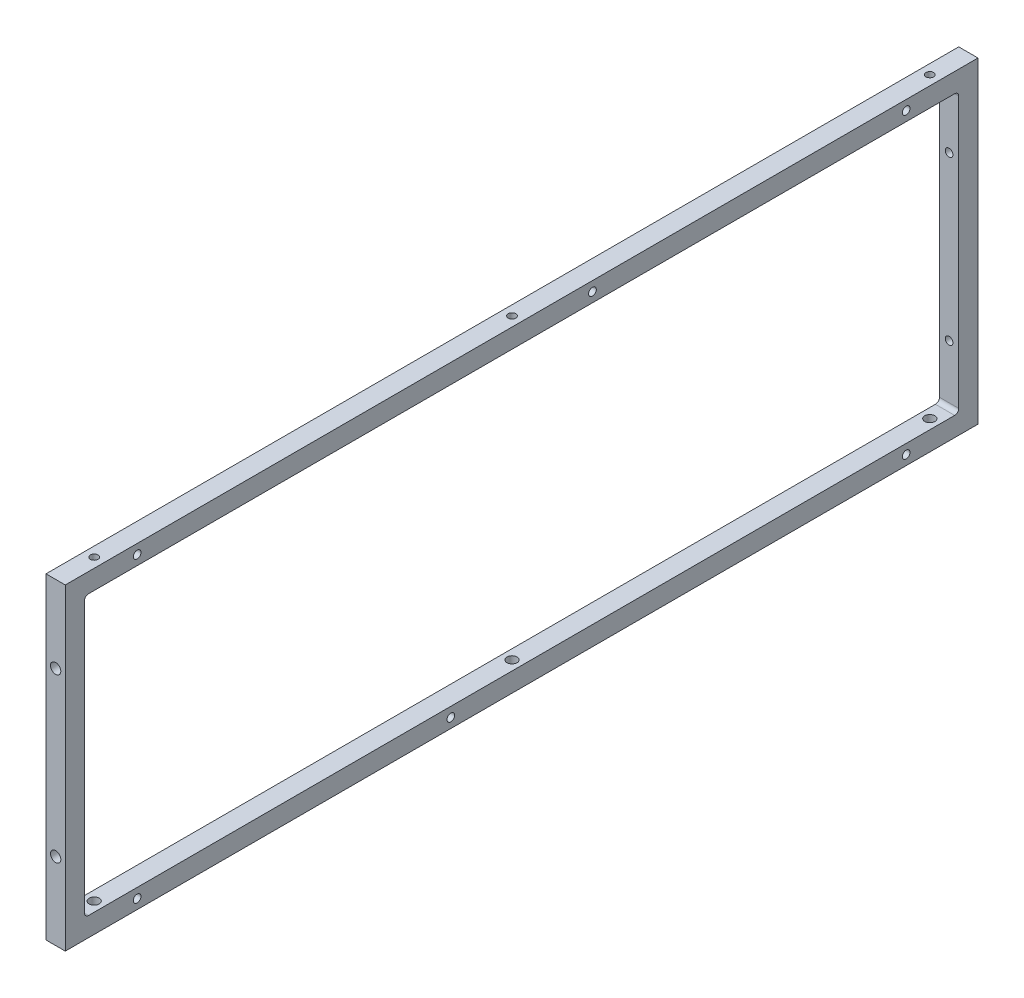
ISO-10303-21;
HEADER;
FILE_DESCRIPTION(('STEP AP214'),'2;1');
FILE_NAME('part.step','',(''),(''),'','','');
FILE_SCHEMA(('AUTOMOTIVE_DESIGN { 1 0 10303 214 1 1 1 1 }'));
ENDSEC;
DATA;
#1=APPLICATION_CONTEXT('core data for automotive mechanical design processes');
#2=APPLICATION_PROTOCOL_DEFINITION('international standard','automotive_design',2000,#1);
#3=PRODUCT_CONTEXT('',#1,'mechanical');
#4=PRODUCT('Part','Part','',(#3));
#5=PRODUCT_RELATED_PRODUCT_CATEGORY('part','',(#4));
#6=PRODUCT_DEFINITION_FORMATION('','',#4);
#7=PRODUCT_DEFINITION_CONTEXT('part definition',#1,'design');
#8=PRODUCT_DEFINITION('design','',#6,#7);
#9=PRODUCT_DEFINITION_SHAPE('','',#8);
#10=(LENGTH_UNIT() NAMED_UNIT(*) SI_UNIT(.MILLI.,.METRE.));
#11=(NAMED_UNIT(*) PLANE_ANGLE_UNIT() SI_UNIT($,.RADIAN.));
#12=(NAMED_UNIT(*) SI_UNIT($,.STERADIAN.) SOLID_ANGLE_UNIT());
#13=UNCERTAINTY_MEASURE_WITH_UNIT(LENGTH_MEASURE(1.E-05),#10,'distance_accuracy_value','');
#14=(GEOMETRIC_REPRESENTATION_CONTEXT(3) GLOBAL_UNCERTAINTY_ASSIGNED_CONTEXT((#13)) GLOBAL_UNIT_ASSIGNED_CONTEXT((#10,
#11,#12)) REPRESENTATION_CONTEXT('',''));
#15=CARTESIAN_POINT('',(0.,0.,0.));
#16=DIRECTION('',(0.,0.,1.));
#17=DIRECTION('',(1.,0.,0.));
#18=AXIS2_PLACEMENT_3D('',#15,#16,#17);
#19=CARTESIAN_POINT('',(4.7625,0.,0.));
#20=DIRECTION('',(1.,0.,0.));
#21=DIRECTION('',(0.,0.,-1.));
#22=AXIS2_PLACEMENT_3D('',#19,#20,#21);
#23=PLANE('',#22);
#24=CARTESIAN_POINT('',(4.7625,73.59110835,-190.));
#25=DIRECTION('',(1.,0.,0.));
#26=DIRECTION('',(0.,0.,-1.));
#27=AXIS2_PLACEMENT_3D('',#24,#25,#26);
#28=CIRCLE('',#27,1.89865);
#29=CARTESIAN_POINT('',(4.7625,73.59110835,-191.89865));
#30=VERTEX_POINT('',#29);
#31=EDGE_CURVE('E393',#30,#30,#28,.T.);
#32=ORIENTED_EDGE('',*,*,#31,.F.);
#33=EDGE_LOOP('',(#32));
#34=FACE_BOUND('',#33,.T.);
#35=CARTESIAN_POINT('',(4.7625,73.59110835,-35.));
#36=DIRECTION('',(1.,0.,0.));
#37=DIRECTION('',(0.,0.,-1.));
#38=AXIS2_PLACEMENT_3D('',#35,#36,#37);
#39=CIRCLE('',#38,1.89865);
#40=CARTESIAN_POINT('',(4.7625,73.59110835,-36.89865));
#41=VERTEX_POINT('',#40);
#42=EDGE_CURVE('E399',#41,#41,#39,.T.);
#43=ORIENTED_EDGE('',*,*,#42,.F.);
#44=EDGE_LOOP('',(#43));
#45=FACE_BOUND('',#44,.T.);
#46=CARTESIAN_POINT('',(4.7625,-73.59110835,-190.));
#47=DIRECTION('',(1.,0.,0.));
#48=DIRECTION('',(0.,0.,-1.));
#49=AXIS2_PLACEMENT_3D('',#46,#47,#48);
#50=CIRCLE('',#49,1.89865);
#51=CARTESIAN_POINT('',(4.7625,-73.59110835,-191.89865));
#52=VERTEX_POINT('',#51);
#53=EDGE_CURVE('E405',#52,#52,#50,.T.);
#54=ORIENTED_EDGE('',*,*,#53,.F.);
#55=EDGE_LOOP('',(#54));
#56=FACE_BOUND('',#55,.T.);
#57=CARTESIAN_POINT('',(4.7625,-73.59110835,35.));
#58=DIRECTION('',(1.,0.,0.));
#59=DIRECTION('',(0.,0.,-1.));
#60=AXIS2_PLACEMENT_3D('',#57,#58,#59);
#61=CIRCLE('',#60,1.89865);
#62=CARTESIAN_POINT('',(4.7625,-73.59110835,33.10135));
#63=VERTEX_POINT('',#62);
#64=EDGE_CURVE('E411',#63,#63,#61,.T.);
#65=ORIENTED_EDGE('',*,*,#64,.F.);
#66=EDGE_LOOP('',(#65));
#67=FACE_BOUND('',#66,.T.);
#68=CARTESIAN_POINT('',(4.7625,-73.59110835,190.));
#69=DIRECTION('',(1.,0.,0.));
#70=DIRECTION('',(0.,0.,-1.));
#71=AXIS2_PLACEMENT_3D('',#68,#69,#70);
#72=CIRCLE('',#71,1.89865);
#73=CARTESIAN_POINT('',(4.7625,-73.59110835,188.10135));
#74=VERTEX_POINT('',#73);
#75=EDGE_CURVE('E417',#74,#74,#72,.T.);
#76=ORIENTED_EDGE('',*,*,#75,.F.);
#77=EDGE_LOOP('',(#76));
#78=FACE_BOUND('',#77,.T.);
#79=CARTESIAN_POINT('',(4.7625,73.59110835,190.));
#80=DIRECTION('',(1.,0.,0.));
#81=DIRECTION('',(0.,0.,-1.));
#82=AXIS2_PLACEMENT_3D('',#79,#80,#81);
#83=CIRCLE('',#82,1.89865);
#84=CARTESIAN_POINT('',(4.7625,73.59110835,188.10135));
#85=VERTEX_POINT('',#84);
#86=EDGE_CURVE('E423',#85,#85,#83,.T.);
#87=ORIENTED_EDGE('',*,*,#86,.F.);
#88=EDGE_LOOP('',(#87));
#89=FACE_BOUND('',#88,.T.);
#90=DIRECTION('',(0.,-1.,0.));
#91=VECTOR('',#90,1.);
#92=CARTESIAN_POINT('',(4.7625,78.35360835,225.5));
#93=LINE('',#92,#91);
#94=CARTESIAN_POINT('',(4.7625,78.35360835,225.5));
#95=VERTEX_POINT('',#94);
#96=CARTESIAN_POINT('',(4.7625,-78.35360835,225.5));
#97=VERTEX_POINT('',#96);
#98=EDGE_CURVE('E162',#95,#97,#93,.T.);
#99=ORIENTED_EDGE('',*,*,#98,.T.);
#100=DIRECTION('',(0.,0.,-1.));
#101=VECTOR('',#100,1.);
#102=CARTESIAN_POINT('',(4.7625,-78.35360835,225.5));
#103=LINE('',#102,#101);
#104=CARTESIAN_POINT('',(4.7625,-78.35360835,-225.5));
#105=VERTEX_POINT('',#104);
#106=EDGE_CURVE('E151',#97,#105,#103,.T.);
#107=ORIENTED_EDGE('',*,*,#106,.T.);
#108=DIRECTION('',(0.,1.,0.));
#109=VECTOR('',#108,1.);
#110=CARTESIAN_POINT('',(4.7625,78.35360835,-225.5));
#111=LINE('',#110,#109);
#112=CARTESIAN_POINT('',(4.7625,78.35360835,-225.5));
#113=VERTEX_POINT('',#112);
#114=EDGE_CURVE('E161',#105,#113,#111,.T.);
#115=ORIENTED_EDGE('',*,*,#114,.T.);
#116=DIRECTION('',(0.,0.,1.));
#117=VECTOR('',#116,1.);
#118=CARTESIAN_POINT('',(4.7625,78.35360835,225.5));
#119=LINE('',#118,#117);
#120=EDGE_CURVE('E166',#113,#95,#119,.T.);
#121=ORIENTED_EDGE('',*,*,#120,.T.);
#122=EDGE_LOOP('',(#99,#107,#115,#121));
#123=FACE_BOUND('',#122,.T.);
#124=DIRECTION('',(0.,0.,-1.));
#125=VECTOR('',#124,1.);
#126=CARTESIAN_POINT('',(4.7625,-68.82860835,225.5));
#127=LINE('',#126,#125);
#128=CARTESIAN_POINT('',(4.7625,-68.82860835,213.975));
#129=VERTEX_POINT('',#128);
#130=CARTESIAN_POINT('',(4.7625,-68.82860835,-213.975));
#131=VERTEX_POINT('',#130);
#132=EDGE_CURVE('E233',#129,#131,#127,.T.);
#133=ORIENTED_EDGE('',*,*,#132,.F.);
#134=CARTESIAN_POINT('',(4.7625,-66.82860835,213.975));
#135=DIRECTION('',(1.,0.,0.));
#136=DIRECTION('',(0.,0.,-1.));
#137=AXIS2_PLACEMENT_3D('',#134,#135,#136);
#138=CIRCLE('',#137,2.);
#139=CARTESIAN_POINT('',(4.7625,-66.82860835,215.975));
#140=VERTEX_POINT('',#139);
#141=EDGE_CURVE('E205',#129,#140,#138,.F.);
#142=ORIENTED_EDGE('',*,*,#141,.T.);
#143=DIRECTION('',(0.,-1.,0.));
#144=VECTOR('',#143,1.);
#145=CARTESIAN_POINT('',(4.7625,78.35360835,215.975));
#146=LINE('',#145,#144);
#147=CARTESIAN_POINT('',(4.7625,66.82860835,215.975));
#148=VERTEX_POINT('',#147);
#149=EDGE_CURVE('E221',#148,#140,#146,.T.);
#150=ORIENTED_EDGE('',*,*,#149,.F.);
#151=CARTESIAN_POINT('',(4.7625,66.82860835,213.975));
#152=DIRECTION('',(1.,0.,0.));
#153=DIRECTION('',(0.,0.,-1.));
#154=AXIS2_PLACEMENT_3D('',#151,#152,#153);
#155=CIRCLE('',#154,2.);
#156=CARTESIAN_POINT('',(4.7625,68.82860835,213.975));
#157=VERTEX_POINT('',#156);
#158=EDGE_CURVE('E76',#148,#157,#155,.F.);
#159=ORIENTED_EDGE('',*,*,#158,.T.);
#160=DIRECTION('',(0.,0.,1.));
#161=VECTOR('',#160,1.);
#162=CARTESIAN_POINT('',(4.7625,68.82860835,225.5));
#163=LINE('',#162,#161);
#164=CARTESIAN_POINT('',(4.7625,68.82860835,-213.975));
#165=VERTEX_POINT('',#164);
#166=EDGE_CURVE('E229',#165,#157,#163,.T.);
#167=ORIENTED_EDGE('',*,*,#166,.F.);
#168=CARTESIAN_POINT('',(4.7625,66.82860835,-213.975));
#169=DIRECTION('',(1.,0.,0.));
#170=DIRECTION('',(0.,0.,-1.));
#171=AXIS2_PLACEMENT_3D('',#168,#169,#170);
#172=CIRCLE('',#171,2.);
#173=CARTESIAN_POINT('',(4.7625,66.82860835,-215.975));
#174=VERTEX_POINT('',#173);
#175=EDGE_CURVE('E12',#165,#174,#172,.F.);
#176=ORIENTED_EDGE('',*,*,#175,.T.);
#177=DIRECTION('',(0.,1.,0.));
#178=VECTOR('',#177,1.);
#179=CARTESIAN_POINT('',(4.7625,78.35360835,-215.975));
#180=LINE('',#179,#178);
#181=CARTESIAN_POINT('',(4.7625,-66.82860835,-215.975));
#182=VERTEX_POINT('',#181);
#183=EDGE_CURVE('E227',#182,#174,#180,.T.);
#184=ORIENTED_EDGE('',*,*,#183,.F.);
#185=CARTESIAN_POINT('',(4.7625,-66.82860835,-213.975));
#186=DIRECTION('',(1.,0.,0.));
#187=DIRECTION('',(0.,0.,-1.));
#188=AXIS2_PLACEMENT_3D('',#185,#186,#187);
#189=CIRCLE('',#188,2.);
#190=EDGE_CURVE('E201',#182,#131,#189,.F.);
#191=ORIENTED_EDGE('',*,*,#190,.T.);
#192=EDGE_LOOP('',(#133,#142,#150,#159,#167,#176,#184,#191));
#193=FACE_BOUND('',#192,.T.);
#194=ADVANCED_FACE('F60',(#34,#45,#56,#67,#78,#89,#123,#193),#23,.T.);
#195=CARTESIAN_POINT('',(-4.7625,0.,0.));
#196=DIRECTION('',(1.,0.,0.));
#197=DIRECTION('',(0.,0.,-1.));
#198=AXIS2_PLACEMENT_3D('',#195,#196,#197);
#199=PLANE('',#198);
#200=CARTESIAN_POINT('',(-4.7625,73.59110835,-190.));
#201=DIRECTION('',(-1.,0.,0.));
#202=DIRECTION('',(0.,0.,1.));
#203=AXIS2_PLACEMENT_3D('',#200,#201,#202);
#204=CIRCLE('',#203,1.89865);
#205=CARTESIAN_POINT('',(-4.7625,73.59110835,-188.10135));
#206=VERTEX_POINT('',#205);
#207=EDGE_CURVE('E390',#206,#206,#204,.T.);
#208=ORIENTED_EDGE('',*,*,#207,.F.);
#209=EDGE_LOOP('',(#208));
#210=FACE_BOUND('',#209,.T.);
#211=CARTESIAN_POINT('',(-4.7625,73.59110835,-35.));
#212=DIRECTION('',(-1.,0.,0.));
#213=DIRECTION('',(0.,0.,1.));
#214=AXIS2_PLACEMENT_3D('',#211,#212,#213);
#215=CIRCLE('',#214,1.89865);
#216=CARTESIAN_POINT('',(-4.7625,73.59110835,-33.10135));
#217=VERTEX_POINT('',#216);
#218=EDGE_CURVE('E396',#217,#217,#215,.T.);
#219=ORIENTED_EDGE('',*,*,#218,.F.);
#220=EDGE_LOOP('',(#219));
#221=FACE_BOUND('',#220,.T.);
#222=CARTESIAN_POINT('',(-4.7625,-73.59110835,-190.));
#223=DIRECTION('',(-1.,0.,0.));
#224=DIRECTION('',(0.,0.,1.));
#225=AXIS2_PLACEMENT_3D('',#222,#223,#224);
#226=CIRCLE('',#225,1.89865);
#227=CARTESIAN_POINT('',(-4.7625,-73.59110835,-188.10135));
#228=VERTEX_POINT('',#227);
#229=EDGE_CURVE('E402',#228,#228,#226,.T.);
#230=ORIENTED_EDGE('',*,*,#229,.F.);
#231=EDGE_LOOP('',(#230));
#232=FACE_BOUND('',#231,.T.);
#233=CARTESIAN_POINT('',(-4.7625,-73.59110835,35.));
#234=DIRECTION('',(-1.,0.,0.));
#235=DIRECTION('',(0.,0.,1.));
#236=AXIS2_PLACEMENT_3D('',#233,#234,#235);
#237=CIRCLE('',#236,1.89865);
#238=CARTESIAN_POINT('',(-4.7625,-73.59110835,36.89865));
#239=VERTEX_POINT('',#238);
#240=EDGE_CURVE('E408',#239,#239,#237,.T.);
#241=ORIENTED_EDGE('',*,*,#240,.F.);
#242=EDGE_LOOP('',(#241));
#243=FACE_BOUND('',#242,.T.);
#244=CARTESIAN_POINT('',(-4.7625,-73.59110835,190.));
#245=DIRECTION('',(-1.,0.,0.));
#246=DIRECTION('',(0.,0.,1.));
#247=AXIS2_PLACEMENT_3D('',#244,#245,#246);
#248=CIRCLE('',#247,1.89865);
#249=CARTESIAN_POINT('',(-4.7625,-73.59110835,191.89865));
#250=VERTEX_POINT('',#249);
#251=EDGE_CURVE('E414',#250,#250,#248,.T.);
#252=ORIENTED_EDGE('',*,*,#251,.F.);
#253=EDGE_LOOP('',(#252));
#254=FACE_BOUND('',#253,.T.);
#255=CARTESIAN_POINT('',(-4.7625,73.59110835,190.));
#256=DIRECTION('',(-1.,0.,0.));
#257=DIRECTION('',(0.,0.,1.));
#258=AXIS2_PLACEMENT_3D('',#255,#256,#257);
#259=CIRCLE('',#258,1.89865);
#260=CARTESIAN_POINT('',(-4.7625,73.59110835,191.89865));
#261=VERTEX_POINT('',#260);
#262=EDGE_CURVE('E420',#261,#261,#259,.T.);
#263=ORIENTED_EDGE('',*,*,#262,.F.);
#264=EDGE_LOOP('',(#263));
#265=FACE_BOUND('',#264,.T.);
#266=DIRECTION('',(0.,-1.,0.));
#267=VECTOR('',#266,1.);
#268=CARTESIAN_POINT('',(-4.7625,78.35360835,225.5));
#269=LINE('',#268,#267);
#270=CARTESIAN_POINT('',(-4.7625,78.35360835,225.5));
#271=VERTEX_POINT('',#270);
#272=CARTESIAN_POINT('',(-4.7625,-78.35360835,225.5));
#273=VERTEX_POINT('',#272);
#274=EDGE_CURVE('E174',#271,#273,#269,.T.);
#275=ORIENTED_EDGE('',*,*,#274,.F.);
#276=DIRECTION('',(0.,0.,1.));
#277=VECTOR('',#276,1.);
#278=CARTESIAN_POINT('',(-4.7625,78.35360835,225.5));
#279=LINE('',#278,#277);
#280=CARTESIAN_POINT('',(-4.7625,78.35360835,-225.5));
#281=VERTEX_POINT('',#280);
#282=EDGE_CURVE('E170',#281,#271,#279,.T.);
#283=ORIENTED_EDGE('',*,*,#282,.F.);
#284=DIRECTION('',(0.,1.,0.));
#285=VECTOR('',#284,1.);
#286=CARTESIAN_POINT('',(-4.7625,78.35360835,-225.5));
#287=LINE('',#286,#285);
#288=CARTESIAN_POINT('',(-4.7625,-78.35360835,-225.5));
#289=VERTEX_POINT('',#288);
#290=EDGE_CURVE('E254',#289,#281,#287,.T.);
#291=ORIENTED_EDGE('',*,*,#290,.F.);
#292=DIRECTION('',(0.,0.,-1.));
#293=VECTOR('',#292,1.);
#294=CARTESIAN_POINT('',(-4.7625,-78.35360835,225.5));
#295=LINE('',#294,#293);
#296=EDGE_CURVE('E252',#273,#289,#295,.T.);
#297=ORIENTED_EDGE('',*,*,#296,.F.);
#298=EDGE_LOOP('',(#275,#283,#291,#297));
#299=FACE_BOUND('',#298,.T.);
#300=DIRECTION('',(0.,0.,1.));
#301=VECTOR('',#300,1.);
#302=CARTESIAN_POINT('',(-4.7625,68.82860835,225.5));
#303=LINE('',#302,#301);
#304=CARTESIAN_POINT('',(-4.7625,68.82860835,-213.975));
#305=VERTEX_POINT('',#304);
#306=CARTESIAN_POINT('',(-4.7625,68.82860835,213.975));
#307=VERTEX_POINT('',#306);
#308=EDGE_CURVE('E214',#305,#307,#303,.T.);
#309=ORIENTED_EDGE('',*,*,#308,.T.);
#310=CARTESIAN_POINT('',(-4.7625,66.82860835,213.975));
#311=DIRECTION('',(1.,0.,0.));
#312=DIRECTION('',(0.,0.,-1.));
#313=AXIS2_PLACEMENT_3D('',#310,#311,#312);
#314=CIRCLE('',#313,2.);
#315=CARTESIAN_POINT('',(-4.7625,66.82860835,215.975));
#316=VERTEX_POINT('',#315);
#317=EDGE_CURVE('E207',#307,#316,#314,.T.);
#318=ORIENTED_EDGE('',*,*,#317,.T.);
#319=DIRECTION('',(0.,-1.,0.));
#320=VECTOR('',#319,1.);
#321=CARTESIAN_POINT('',(-4.7625,78.35360835,215.975));
#322=LINE('',#321,#320);
#323=CARTESIAN_POINT('',(-4.7625,-66.82860835,215.975));
#324=VERTEX_POINT('',#323);
#325=EDGE_CURVE('E240',#316,#324,#322,.T.);
#326=ORIENTED_EDGE('',*,*,#325,.T.);
#327=CARTESIAN_POINT('',(-4.7625,-66.82860835,213.975));
#328=DIRECTION('',(1.,0.,0.));
#329=DIRECTION('',(0.,0.,-1.));
#330=AXIS2_PLACEMENT_3D('',#327,#328,#329);
#331=CIRCLE('',#330,2.);
#332=CARTESIAN_POINT('',(-4.7625,-68.82860835,213.975));
#333=VERTEX_POINT('',#332);
#334=EDGE_CURVE('E203',#324,#333,#331,.T.);
#335=ORIENTED_EDGE('',*,*,#334,.T.);
#336=DIRECTION('',(0.,0.,-1.));
#337=VECTOR('',#336,1.);
#338=CARTESIAN_POINT('',(-4.7625,-68.82860835,225.5));
#339=LINE('',#338,#337);
#340=CARTESIAN_POINT('',(-4.7625,-68.82860835,-213.975));
#341=VERTEX_POINT('',#340);
#342=EDGE_CURVE('E243',#333,#341,#339,.T.);
#343=ORIENTED_EDGE('',*,*,#342,.T.);
#344=CARTESIAN_POINT('',(-4.7625,-66.82860835,-213.975));
#345=DIRECTION('',(1.,0.,0.));
#346=DIRECTION('',(0.,0.,-1.));
#347=AXIS2_PLACEMENT_3D('',#344,#345,#346);
#348=CIRCLE('',#347,2.);
#349=CARTESIAN_POINT('',(-4.7625,-66.82860835,-215.975));
#350=VERTEX_POINT('',#349);
#351=EDGE_CURVE('E199',#341,#350,#348,.T.);
#352=ORIENTED_EDGE('',*,*,#351,.T.);
#353=DIRECTION('',(0.,1.,0.));
#354=VECTOR('',#353,1.);
#355=CARTESIAN_POINT('',(-4.7625,78.35360835,-215.975));
#356=LINE('',#355,#354);
#357=CARTESIAN_POINT('',(-4.7625,66.82860835,-215.975));
#358=VERTEX_POINT('',#357);
#359=EDGE_CURVE('E216',#350,#358,#356,.T.);
#360=ORIENTED_EDGE('',*,*,#359,.T.);
#361=CARTESIAN_POINT('',(-4.7625,66.82860835,-213.975));
#362=DIRECTION('',(1.,0.,0.));
#363=DIRECTION('',(0.,0.,-1.));
#364=AXIS2_PLACEMENT_3D('',#361,#362,#363);
#365=CIRCLE('',#364,2.);
#366=EDGE_CURVE('E69',#358,#305,#365,.T.);
#367=ORIENTED_EDGE('',*,*,#366,.T.);
#368=EDGE_LOOP('',(#309,#318,#326,#335,#343,#352,#360,#367));
#369=FACE_BOUND('',#368,.T.);
#370=ADVANCED_FACE('F213',(#210,#221,#232,#243,#254,#265,#299,#369),#199,.F.);
#371=CARTESIAN_POINT('',(4.7625,78.35360835,225.5));
#372=DIRECTION('',(0.,0.,-1.));
#373=DIRECTION('',(-1.,0.,0.));
#374=AXIS2_PLACEMENT_3D('',#371,#372,#373);
#375=PLANE('',#374);
#376=CARTESIAN_POINT('',(0.,40.25360835,225.5));
#377=DIRECTION('',(0.,0.,1.));
#378=DIRECTION('',(1.,0.,0.));
#379=AXIS2_PLACEMENT_3D('',#376,#377,#378);
#380=CIRCLE('',#379,2.55269999999999);
#381=CARTESIAN_POINT('',(2.55269999999999,40.25360835,225.5));
#382=VERTEX_POINT('',#381);
#383=EDGE_CURVE('E426',#382,#382,#380,.T.);
#384=ORIENTED_EDGE('',*,*,#383,.F.);
#385=EDGE_LOOP('',(#384));
#386=FACE_BOUND('',#385,.T.);
#387=CARTESIAN_POINT('',(0.,-40.25360835,225.5));
#388=DIRECTION('',(0.,0.,1.));
#389=DIRECTION('',(1.,0.,0.));
#390=AXIS2_PLACEMENT_3D('',#387,#388,#389);
#391=CIRCLE('',#390,2.55269999999999);
#392=CARTESIAN_POINT('',(2.55269999999999,-40.25360835,225.5));
#393=VERTEX_POINT('',#392);
#394=EDGE_CURVE('E432',#393,#393,#391,.T.);
#395=ORIENTED_EDGE('',*,*,#394,.F.);
#396=EDGE_LOOP('',(#395));
#397=FACE_BOUND('',#396,.T.);
#398=ORIENTED_EDGE('',*,*,#274,.T.);
#399=DIRECTION('',(-1.,0.,0.));
#400=VECTOR('',#399,1.);
#401=CARTESIAN_POINT('',(4.7625,-78.35360835,225.5));
#402=LINE('',#401,#400);
#403=EDGE_CURVE('E155',#97,#273,#402,.T.);
#404=ORIENTED_EDGE('',*,*,#403,.F.);
#405=ORIENTED_EDGE('',*,*,#98,.F.);
#406=DIRECTION('',(-1.,0.,0.));
#407=VECTOR('',#406,1.);
#408=CARTESIAN_POINT('',(4.7625,78.35360835,225.5));
#409=LINE('',#408,#407);
#410=EDGE_CURVE('E250',#95,#271,#409,.T.);
#411=ORIENTED_EDGE('',*,*,#410,.T.);
#412=EDGE_LOOP('',(#398,#404,#405,#411));
#413=FACE_BOUND('',#412,.T.);
#414=ADVANCED_FACE('F172',(#386,#397,#413),#375,.F.);
#415=CARTESIAN_POINT('',(4.7625,-78.35360835,225.5));
#416=DIRECTION('',(0.,1.,0.));
#417=DIRECTION('',(0.,0.,1.));
#418=AXIS2_PLACEMENT_3D('',#415,#416,#417);
#419=PLANE('',#418);
#420=CARTESIAN_POINT('',(0.,-78.35360835,-206.45));
#421=DIRECTION('',(0.,1.,0.));
#422=DIRECTION('',(0.,0.,1.));
#423=AXIS2_PLACEMENT_3D('',#420,#421,#422);
#424=CIRCLE('',#423,2.4892);
#425=CARTESIAN_POINT('',(0.,-78.35360835,-203.9608));
#426=VERTEX_POINT('',#425);
#427=EDGE_CURVE('E453',#426,#426,#424,.T.);
#428=ORIENTED_EDGE('',*,*,#427,.T.);
#429=EDGE_LOOP('',(#428));
#430=FACE_BOUND('',#429,.T.);
#431=CARTESIAN_POINT('',(0.,-78.35360835,0.));
#432=DIRECTION('',(0.,1.,0.));
#433=DIRECTION('',(0.,0.,1.));
#434=AXIS2_PLACEMENT_3D('',#431,#432,#433);
#435=CIRCLE('',#434,2.4892);
#436=CARTESIAN_POINT('',(0.,-78.35360835,2.4892));
#437=VERTEX_POINT('',#436);
#438=EDGE_CURVE('E459',#437,#437,#435,.T.);
#439=ORIENTED_EDGE('',*,*,#438,.T.);
#440=EDGE_LOOP('',(#439));
#441=FACE_BOUND('',#440,.T.);
#442=CARTESIAN_POINT('',(0.,-78.35360835,206.45));
#443=DIRECTION('',(0.,1.,0.));
#444=DIRECTION('',(0.,0.,1.));
#445=AXIS2_PLACEMENT_3D('',#442,#443,#444);
#446=CIRCLE('',#445,2.4892);
#447=CARTESIAN_POINT('',(0.,-78.35360835,208.9392));
#448=VERTEX_POINT('',#447);
#449=EDGE_CURVE('E244',#448,#448,#446,.T.);
#450=ORIENTED_EDGE('',*,*,#449,.T.);
#451=EDGE_LOOP('',(#450));
#452=FACE_BOUND('',#451,.T.);
#453=ORIENTED_EDGE('',*,*,#296,.T.);
#454=DIRECTION('',(-1.,0.,0.));
#455=VECTOR('',#454,1.);
#456=CARTESIAN_POINT('',(4.7625,-78.35360835,-225.5));
#457=LINE('',#456,#455);
#458=EDGE_CURVE('E158',#105,#289,#457,.T.);
#459=ORIENTED_EDGE('',*,*,#458,.F.);
#460=ORIENTED_EDGE('',*,*,#106,.F.);
#461=ORIENTED_EDGE('',*,*,#403,.T.);
#462=EDGE_LOOP('',(#453,#459,#460,#461));
#463=FACE_BOUND('',#462,.T.);
#464=ADVANCED_FACE('F153',(#430,#441,#452,#463),#419,.F.);
#465=CARTESIAN_POINT('',(4.7625,78.35360835,-225.5));
#466=DIRECTION('',(0.,0.,1.));
#467=DIRECTION('',(1.,0.,0.));
#468=AXIS2_PLACEMENT_3D('',#465,#466,#467);
#469=PLANE('',#468);
#470=CARTESIAN_POINT('',(0.,40.25360835,-225.5));
#471=DIRECTION('',(0.,0.,-1.));
#472=DIRECTION('',(0.,1.,0.));
#473=AXIS2_PLACEMENT_3D('',#470,#471,#472);
#474=CIRCLE('',#473,1.89864999999999);
#475=CARTESIAN_POINT('',(0.,42.15225835,-225.5));
#476=VERTEX_POINT('',#475);
#477=EDGE_CURVE('E438',#476,#476,#474,.T.);
#478=ORIENTED_EDGE('',*,*,#477,.F.);
#479=EDGE_LOOP('',(#478));
#480=FACE_BOUND('',#479,.T.);
#481=CARTESIAN_POINT('',(0.,-40.25360835,-225.5));
#482=DIRECTION('',(0.,0.,-1.));
#483=DIRECTION('',(0.,1.,0.));
#484=AXIS2_PLACEMENT_3D('',#481,#482,#483);
#485=CIRCLE('',#484,1.89864999999999);
#486=CARTESIAN_POINT('',(0.,-38.35495835,-225.5));
#487=VERTEX_POINT('',#486);
#488=EDGE_CURVE('E444',#487,#487,#485,.T.);
#489=ORIENTED_EDGE('',*,*,#488,.F.);
#490=EDGE_LOOP('',(#489));
#491=FACE_BOUND('',#490,.T.);
#492=ORIENTED_EDGE('',*,*,#290,.T.);
#493=DIRECTION('',(-1.,0.,0.));
#494=VECTOR('',#493,1.);
#495=CARTESIAN_POINT('',(4.7625,78.35360835,-225.5));
#496=LINE('',#495,#494);
#497=EDGE_CURVE('E179',#113,#281,#496,.T.);
#498=ORIENTED_EDGE('',*,*,#497,.F.);
#499=ORIENTED_EDGE('',*,*,#114,.F.);
#500=ORIENTED_EDGE('',*,*,#458,.T.);
#501=EDGE_LOOP('',(#492,#498,#499,#500));
#502=FACE_BOUND('',#501,.T.);
#503=ADVANCED_FACE('F265',(#480,#491,#502),#469,.F.);
#504=CARTESIAN_POINT('',(4.7625,78.35360835,225.5));
#505=DIRECTION('',(0.,-1.,0.));
#506=DIRECTION('',(0.,0.,-1.));
#507=AXIS2_PLACEMENT_3D('',#504,#505,#506);
#508=PLANE('',#507);
#509=CARTESIAN_POINT('',(0.,78.35360835,-206.45));
#510=DIRECTION('',(0.,1.,0.));
#511=DIRECTION('',(0.,0.,1.));
#512=AXIS2_PLACEMENT_3D('',#509,#510,#511);
#513=CIRCLE('',#512,1.89864999999999);
#514=CARTESIAN_POINT('',(0.,78.35360835,-204.55135));
#515=VERTEX_POINT('',#514);
#516=EDGE_CURVE('E375',#515,#515,#513,.T.);
#517=ORIENTED_EDGE('',*,*,#516,.F.);
#518=EDGE_LOOP('',(#517));
#519=FACE_BOUND('',#518,.T.);
#520=CARTESIAN_POINT('',(0.,78.35360835,0.));
#521=DIRECTION('',(0.,1.,0.));
#522=DIRECTION('',(0.,0.,1.));
#523=AXIS2_PLACEMENT_3D('',#520,#521,#522);
#524=CIRCLE('',#523,1.89864999999999);
#525=CARTESIAN_POINT('',(0.,78.35360835,1.89864999999999));
#526=VERTEX_POINT('',#525);
#527=EDGE_CURVE('E377',#526,#526,#524,.T.);
#528=ORIENTED_EDGE('',*,*,#527,.F.);
#529=EDGE_LOOP('',(#528));
#530=FACE_BOUND('',#529,.T.);
#531=CARTESIAN_POINT('',(0.,78.35360835,206.45));
#532=DIRECTION('',(0.,1.,0.));
#533=DIRECTION('',(0.,0.,1.));
#534=AXIS2_PLACEMENT_3D('',#531,#532,#533);
#535=CIRCLE('',#534,1.89864999999999);
#536=CARTESIAN_POINT('',(0.,78.35360835,208.34865));
#537=VERTEX_POINT('',#536);
#538=EDGE_CURVE('E384',#537,#537,#535,.T.);
#539=ORIENTED_EDGE('',*,*,#538,.F.);
#540=EDGE_LOOP('',(#539));
#541=FACE_BOUND('',#540,.T.);
#542=ORIENTED_EDGE('',*,*,#282,.T.);
#543=ORIENTED_EDGE('',*,*,#410,.F.);
#544=ORIENTED_EDGE('',*,*,#120,.F.);
#545=ORIENTED_EDGE('',*,*,#497,.T.);
#546=EDGE_LOOP('',(#542,#543,#544,#545));
#547=FACE_BOUND('',#546,.T.);
#548=ADVANCED_FACE('F261',(#519,#530,#541,#547),#508,.F.);
#549=CARTESIAN_POINT('',(4.7625,78.35360835,215.975));
#550=DIRECTION('',(0.,0.,-1.));
#551=DIRECTION('',(-1.,0.,0.));
#552=AXIS2_PLACEMENT_3D('',#549,#550,#551);
#553=PLANE('',#552);
#554=CARTESIAN_POINT('',(0.,40.25360835,215.975));
#555=DIRECTION('',(0.,0.,-1.));
#556=DIRECTION('',(-1.,0.,0.));
#557=AXIS2_PLACEMENT_3D('',#554,#555,#556);
#558=CIRCLE('',#557,2.55269999999997);
#559=CARTESIAN_POINT('',(-2.55269999999997,40.25360835,215.975));
#560=VERTEX_POINT('',#559);
#561=EDGE_CURVE('E429',#560,#560,#558,.T.);
#562=ORIENTED_EDGE('',*,*,#561,.F.);
#563=EDGE_LOOP('',(#562));
#564=FACE_BOUND('',#563,.T.);
#565=CARTESIAN_POINT('',(0.,-40.25360835,215.975));
#566=DIRECTION('',(0.,0.,-1.));
#567=DIRECTION('',(-1.,0.,0.));
#568=AXIS2_PLACEMENT_3D('',#565,#566,#567);
#569=CIRCLE('',#568,2.55269999999997);
#570=CARTESIAN_POINT('',(-2.55269999999997,-40.25360835,215.975));
#571=VERTEX_POINT('',#570);
#572=EDGE_CURVE('E435',#571,#571,#569,.T.);
#573=ORIENTED_EDGE('',*,*,#572,.F.);
#574=EDGE_LOOP('',(#573));
#575=FACE_BOUND('',#574,.T.);
#576=ORIENTED_EDGE('',*,*,#149,.T.);
#577=DIRECTION('',(-1.,0.,0.));
#578=VECTOR('',#577,1.);
#579=CARTESIAN_POINT('',(-4.7625,-66.82860835,215.975));
#580=LINE('',#579,#578);
#581=EDGE_CURVE('E192',#140,#324,#580,.T.);
#582=ORIENTED_EDGE('',*,*,#581,.T.);
#583=ORIENTED_EDGE('',*,*,#325,.F.);
#584=DIRECTION('',(-1.,0.,0.));
#585=VECTOR('',#584,1.);
#586=CARTESIAN_POINT('',(4.7625,66.82860835,215.975));
#587=LINE('',#586,#585);
#588=EDGE_CURVE('E190',#316,#148,#587,.F.);
#589=ORIENTED_EDGE('',*,*,#588,.T.);
#590=EDGE_LOOP('',(#576,#582,#583,#589));
#591=FACE_BOUND('',#590,.T.);
#592=ADVANCED_FACE('F273',(#564,#575,#591),#553,.T.);
#593=CARTESIAN_POINT('',(4.7625,-68.82860835,225.5));
#594=DIRECTION('',(0.,1.,0.));
#595=DIRECTION('',(0.,0.,1.));
#596=AXIS2_PLACEMENT_3D('',#593,#594,#595);
#597=PLANE('',#596);
#598=CARTESIAN_POINT('',(0.,-68.82860835,-206.45));
#599=DIRECTION('',(0.,1.,0.));
#600=DIRECTION('',(0.,0.,1.));
#601=AXIS2_PLACEMENT_3D('',#598,#599,#600);
#602=CIRCLE('',#601,2.48919999999999);
#603=CARTESIAN_POINT('',(0.,-68.82860835,-203.9608));
#604=VERTEX_POINT('',#603);
#605=EDGE_CURVE('E450',#604,#604,#602,.T.);
#606=ORIENTED_EDGE('',*,*,#605,.F.);
#607=EDGE_LOOP('',(#606));
#608=FACE_BOUND('',#607,.T.);
#609=CARTESIAN_POINT('',(0.,-68.82860835,0.));
#610=DIRECTION('',(0.,1.,0.));
#611=DIRECTION('',(0.,0.,1.));
#612=AXIS2_PLACEMENT_3D('',#609,#610,#611);
#613=CIRCLE('',#612,2.48919999999999);
#614=CARTESIAN_POINT('',(0.,-68.82860835,2.48919999999999));
#615=VERTEX_POINT('',#614);
#616=EDGE_CURVE('E456',#615,#615,#613,.T.);
#617=ORIENTED_EDGE('',*,*,#616,.F.);
#618=EDGE_LOOP('',(#617));
#619=FACE_BOUND('',#618,.T.);
#620=CARTESIAN_POINT('',(0.,-68.82860835,206.45));
#621=DIRECTION('',(0.,1.,0.));
#622=DIRECTION('',(0.,0.,1.));
#623=AXIS2_PLACEMENT_3D('',#620,#621,#622);
#624=CIRCLE('',#623,2.48919999999999);
#625=CARTESIAN_POINT('',(0.,-68.82860835,208.9392));
#626=VERTEX_POINT('',#625);
#627=EDGE_CURVE('E462',#626,#626,#624,.T.);
#628=ORIENTED_EDGE('',*,*,#627,.F.);
#629=EDGE_LOOP('',(#628));
#630=FACE_BOUND('',#629,.T.);
#631=ORIENTED_EDGE('',*,*,#132,.T.);
#632=DIRECTION('',(-1.,0.,0.));
#633=VECTOR('',#632,1.);
#634=CARTESIAN_POINT('',(-4.7625,-68.82860835,-213.975));
#635=LINE('',#634,#633);
#636=EDGE_CURVE('E177',#131,#341,#635,.T.);
#637=ORIENTED_EDGE('',*,*,#636,.T.);
#638=ORIENTED_EDGE('',*,*,#342,.F.);
#639=DIRECTION('',(-1.,0.,0.));
#640=VECTOR('',#639,1.);
#641=CARTESIAN_POINT('',(4.7625,-68.82860835,213.975));
#642=LINE('',#641,#640);
#643=EDGE_CURVE('E175',#333,#129,#642,.F.);
#644=ORIENTED_EDGE('',*,*,#643,.T.);
#645=EDGE_LOOP('',(#631,#637,#638,#644));
#646=FACE_BOUND('',#645,.T.);
#647=ADVANCED_FACE('F293',(#608,#619,#630,#646),#597,.T.);
#648=CARTESIAN_POINT('',(4.7625,78.35360835,-215.975));
#649=DIRECTION('',(0.,0.,1.));
#650=DIRECTION('',(1.,0.,0.));
#651=AXIS2_PLACEMENT_3D('',#648,#649,#650);
#652=PLANE('',#651);
#653=CARTESIAN_POINT('',(0.,40.25360835,-215.975));
#654=DIRECTION('',(0.,0.,1.));
#655=DIRECTION('',(1.,0.,0.));
#656=AXIS2_PLACEMENT_3D('',#653,#654,#655);
#657=CIRCLE('',#656,1.89864999999997);
#658=CARTESIAN_POINT('',(1.89864999999997,40.25360835,-215.975));
#659=VERTEX_POINT('',#658);
#660=EDGE_CURVE('E441',#659,#659,#657,.T.);
#661=ORIENTED_EDGE('',*,*,#660,.F.);
#662=EDGE_LOOP('',(#661));
#663=FACE_BOUND('',#662,.T.);
#664=CARTESIAN_POINT('',(0.,-40.25360835,-215.975));
#665=DIRECTION('',(0.,0.,1.));
#666=DIRECTION('',(1.,0.,0.));
#667=AXIS2_PLACEMENT_3D('',#664,#665,#666);
#668=CIRCLE('',#667,1.89864999999997);
#669=CARTESIAN_POINT('',(1.89864999999997,-40.25360835,-215.975));
#670=VERTEX_POINT('',#669);
#671=EDGE_CURVE('E447',#670,#670,#668,.T.);
#672=ORIENTED_EDGE('',*,*,#671,.F.);
#673=EDGE_LOOP('',(#672));
#674=FACE_BOUND('',#673,.T.);
#675=ORIENTED_EDGE('',*,*,#359,.F.);
#676=DIRECTION('',(-1.,0.,0.));
#677=VECTOR('',#676,1.);
#678=CARTESIAN_POINT('',(4.7625,-66.82860835,-215.975));
#679=LINE('',#678,#677);
#680=EDGE_CURVE('E188',#350,#182,#679,.F.);
#681=ORIENTED_EDGE('',*,*,#680,.T.);
#682=ORIENTED_EDGE('',*,*,#183,.T.);
#683=DIRECTION('',(-1.,0.,0.));
#684=VECTOR('',#683,1.);
#685=CARTESIAN_POINT('',(-4.7625,66.82860835,-215.975));
#686=LINE('',#685,#684);
#687=EDGE_CURVE('E185',#174,#358,#686,.T.);
#688=ORIENTED_EDGE('',*,*,#687,.T.);
#689=EDGE_LOOP('',(#675,#681,#682,#688));
#690=FACE_BOUND('',#689,.T.);
#691=ADVANCED_FACE('F231',(#663,#674,#690),#652,.T.);
#692=CARTESIAN_POINT('',(4.7625,68.82860835,225.5));
#693=DIRECTION('',(0.,-1.,0.));
#694=DIRECTION('',(0.,0.,-1.));
#695=AXIS2_PLACEMENT_3D('',#692,#693,#694);
#696=PLANE('',#695);
#697=CARTESIAN_POINT('',(0.,68.82860835,-206.45));
#698=DIRECTION('',(0.,-1.,0.));
#699=DIRECTION('',(0.,0.,-1.));
#700=AXIS2_PLACEMENT_3D('',#697,#698,#699);
#701=CIRCLE('',#700,1.89864999999999);
#702=CARTESIAN_POINT('',(0.,68.82860835,-208.34865));
#703=VERTEX_POINT('',#702);
#704=EDGE_CURVE('E64',#703,#703,#701,.T.);
#705=ORIENTED_EDGE('',*,*,#704,.F.);
#706=EDGE_LOOP('',(#705));
#707=FACE_BOUND('',#706,.T.);
#708=CARTESIAN_POINT('',(0.,68.82860835,0.));
#709=DIRECTION('',(0.,-1.,0.));
#710=DIRECTION('',(0.,0.,-1.));
#711=AXIS2_PLACEMENT_3D('',#708,#709,#710);
#712=CIRCLE('',#711,1.89864999999999);
#713=CARTESIAN_POINT('',(0.,68.82860835,-1.89864999999999));
#714=VERTEX_POINT('',#713);
#715=EDGE_CURVE('E381',#714,#714,#712,.T.);
#716=ORIENTED_EDGE('',*,*,#715,.F.);
#717=EDGE_LOOP('',(#716));
#718=FACE_BOUND('',#717,.T.);
#719=CARTESIAN_POINT('',(0.,68.82860835,206.45));
#720=DIRECTION('',(0.,-1.,0.));
#721=DIRECTION('',(0.,0.,-1.));
#722=AXIS2_PLACEMENT_3D('',#719,#720,#721);
#723=CIRCLE('',#722,1.89864999999999);
#724=CARTESIAN_POINT('',(0.,68.82860835,204.55135));
#725=VERTEX_POINT('',#724);
#726=EDGE_CURVE('E387',#725,#725,#723,.T.);
#727=ORIENTED_EDGE('',*,*,#726,.F.);
#728=EDGE_LOOP('',(#727));
#729=FACE_BOUND('',#728,.T.);
#730=ORIENTED_EDGE('',*,*,#166,.T.);
#731=DIRECTION('',(-1.,0.,0.));
#732=VECTOR('',#731,1.);
#733=CARTESIAN_POINT('',(-4.7625,68.82860835,213.975));
#734=LINE('',#733,#732);
#735=EDGE_CURVE('E196',#157,#307,#734,.T.);
#736=ORIENTED_EDGE('',*,*,#735,.T.);
#737=ORIENTED_EDGE('',*,*,#308,.F.);
#738=DIRECTION('',(-1.,0.,0.));
#739=VECTOR('',#738,1.);
#740=CARTESIAN_POINT('',(4.7625,68.82860835,-213.975));
#741=LINE('',#740,#739);
#742=EDGE_CURVE('E83',#305,#165,#741,.F.);
#743=ORIENTED_EDGE('',*,*,#742,.T.);
#744=EDGE_LOOP('',(#730,#736,#737,#743));
#745=FACE_BOUND('',#744,.T.);
#746=ADVANCED_FACE('F219',(#707,#718,#729,#745),#696,.T.);
#747=CARTESIAN_POINT('',(4.7625,-66.82860835,-213.975));
#748=DIRECTION('',(1.,0.,0.));
#749=DIRECTION('',(0.,0.,-1.));
#750=AXIS2_PLACEMENT_3D('',#747,#748,#749);
#751=CYLINDRICAL_SURFACE('',#750,2.);
#752=ORIENTED_EDGE('',*,*,#190,.F.);
#753=ORIENTED_EDGE('',*,*,#680,.F.);
#754=ORIENTED_EDGE('',*,*,#351,.F.);
#755=ORIENTED_EDGE('',*,*,#636,.F.);
#756=EDGE_LOOP('',(#752,#753,#754,#755));
#757=FACE_BOUND('',#756,.T.);
#758=ADVANCED_FACE('F303',(#757),#751,.F.);
#759=CARTESIAN_POINT('',(4.7625,-66.82860835,213.975));
#760=DIRECTION('',(1.,0.,0.));
#761=DIRECTION('',(0.,0.,-1.));
#762=AXIS2_PLACEMENT_3D('',#759,#760,#761);
#763=CYLINDRICAL_SURFACE('',#762,2.);
#764=ORIENTED_EDGE('',*,*,#141,.F.);
#765=ORIENTED_EDGE('',*,*,#643,.F.);
#766=ORIENTED_EDGE('',*,*,#334,.F.);
#767=ORIENTED_EDGE('',*,*,#581,.F.);
#768=EDGE_LOOP('',(#764,#765,#766,#767));
#769=FACE_BOUND('',#768,.T.);
#770=ADVANCED_FACE('F473',(#769),#763,.F.);
#771=CARTESIAN_POINT('',(4.7625,66.82860835,213.975));
#772=DIRECTION('',(1.,0.,0.));
#773=DIRECTION('',(0.,0.,-1.));
#774=AXIS2_PLACEMENT_3D('',#771,#772,#773);
#775=CYLINDRICAL_SURFACE('',#774,2.);
#776=ORIENTED_EDGE('',*,*,#158,.F.);
#777=ORIENTED_EDGE('',*,*,#588,.F.);
#778=ORIENTED_EDGE('',*,*,#317,.F.);
#779=ORIENTED_EDGE('',*,*,#735,.F.);
#780=EDGE_LOOP('',(#776,#777,#778,#779));
#781=FACE_BOUND('',#780,.T.);
#782=ADVANCED_FACE('F484',(#781),#775,.F.);
#783=CARTESIAN_POINT('',(4.7625,66.82860835,-213.975));
#784=DIRECTION('',(1.,0.,0.));
#785=DIRECTION('',(0.,0.,-1.));
#786=AXIS2_PLACEMENT_3D('',#783,#784,#785);
#787=CYLINDRICAL_SURFACE('',#786,2.);
#788=ORIENTED_EDGE('',*,*,#175,.F.);
#789=ORIENTED_EDGE('',*,*,#742,.F.);
#790=ORIENTED_EDGE('',*,*,#366,.F.);
#791=ORIENTED_EDGE('',*,*,#687,.F.);
#792=EDGE_LOOP('',(#788,#789,#790,#791));
#793=FACE_BOUND('',#792,.T.);
#794=ADVANCED_FACE('F62',(#793),#787,.F.);
#795=CARTESIAN_POINT('',(0.,-68.82860835,206.45));
#796=DIRECTION('',(0.,1.,0.));
#797=DIRECTION('',(0.,0.,1.));
#798=AXIS2_PLACEMENT_3D('',#795,#796,#797);
#799=CYLINDRICAL_SURFACE('',#798,2.48919999999999);
#800=ORIENTED_EDGE('',*,*,#449,.F.);
#801=EDGE_LOOP('',(#800));
#802=FACE_BOUND('',#801,.T.);
#803=ORIENTED_EDGE('',*,*,#627,.T.);
#804=EDGE_LOOP('',(#803));
#805=FACE_BOUND('',#804,.T.);
#806=ADVANCED_FACE('F305',(#802,#805),#799,.F.);
#807=CARTESIAN_POINT('',(0.,-68.82860835,0.));
#808=DIRECTION('',(0.,1.,0.));
#809=DIRECTION('',(0.,0.,1.));
#810=AXIS2_PLACEMENT_3D('',#807,#808,#809);
#811=CYLINDRICAL_SURFACE('',#810,2.48919999999999);
#812=ORIENTED_EDGE('',*,*,#438,.F.);
#813=EDGE_LOOP('',(#812));
#814=FACE_BOUND('',#813,.T.);
#815=ORIENTED_EDGE('',*,*,#616,.T.);
#816=EDGE_LOOP('',(#815));
#817=FACE_BOUND('',#816,.T.);
#818=ADVANCED_FACE('F308',(#814,#817),#811,.F.);
#819=CARTESIAN_POINT('',(0.,-68.82860835,-206.45));
#820=DIRECTION('',(0.,1.,0.));
#821=DIRECTION('',(0.,0.,1.));
#822=AXIS2_PLACEMENT_3D('',#819,#820,#821);
#823=CYLINDRICAL_SURFACE('',#822,2.48919999999999);
#824=ORIENTED_EDGE('',*,*,#427,.F.);
#825=EDGE_LOOP('',(#824));
#826=FACE_BOUND('',#825,.T.);
#827=ORIENTED_EDGE('',*,*,#605,.T.);
#828=EDGE_LOOP('',(#827));
#829=FACE_BOUND('',#828,.T.);
#830=ADVANCED_FACE('F312',(#826,#829),#823,.F.);
#831=CARTESIAN_POINT('',(0.,-40.25360835,-225.5));
#832=DIRECTION('',(0.,0.,-1.));
#833=DIRECTION('',(0.,1.,0.));
#834=AXIS2_PLACEMENT_3D('',#831,#832,#833);
#835=CYLINDRICAL_SURFACE('',#834,1.89864999999997);
#836=ORIENTED_EDGE('',*,*,#671,.T.);
#837=EDGE_LOOP('',(#836));
#838=FACE_BOUND('',#837,.T.);
#839=ORIENTED_EDGE('',*,*,#488,.T.);
#840=EDGE_LOOP('',(#839));
#841=FACE_BOUND('',#840,.T.);
#842=ADVANCED_FACE('F316',(#838,#841),#835,.F.);
#843=CARTESIAN_POINT('',(0.,40.25360835,-225.5));
#844=DIRECTION('',(0.,0.,-1.));
#845=DIRECTION('',(0.,1.,0.));
#846=AXIS2_PLACEMENT_3D('',#843,#844,#845);
#847=CYLINDRICAL_SURFACE('',#846,1.89864999999997);
#848=ORIENTED_EDGE('',*,*,#660,.T.);
#849=EDGE_LOOP('',(#848));
#850=FACE_BOUND('',#849,.T.);
#851=ORIENTED_EDGE('',*,*,#477,.T.);
#852=EDGE_LOOP('',(#851));
#853=FACE_BOUND('',#852,.T.);
#854=ADVANCED_FACE('F320',(#850,#853),#847,.F.);
#855=CARTESIAN_POINT('',(0.,-40.25360835,225.5));
#856=DIRECTION('',(0.,0.,1.));
#857=DIRECTION('',(1.,0.,0.));
#858=AXIS2_PLACEMENT_3D('',#855,#856,#857);
#859=CYLINDRICAL_SURFACE('',#858,2.55269999999997);
#860=ORIENTED_EDGE('',*,*,#572,.T.);
#861=EDGE_LOOP('',(#860));
#862=FACE_BOUND('',#861,.T.);
#863=ORIENTED_EDGE('',*,*,#394,.T.);
#864=EDGE_LOOP('',(#863));
#865=FACE_BOUND('',#864,.T.);
#866=ADVANCED_FACE('F324',(#862,#865),#859,.F.);
#867=CARTESIAN_POINT('',(0.,40.25360835,225.5));
#868=DIRECTION('',(0.,0.,1.));
#869=DIRECTION('',(1.,0.,0.));
#870=AXIS2_PLACEMENT_3D('',#867,#868,#869);
#871=CYLINDRICAL_SURFACE('',#870,2.55269999999997);
#872=ORIENTED_EDGE('',*,*,#561,.T.);
#873=EDGE_LOOP('',(#872));
#874=FACE_BOUND('',#873,.T.);
#875=ORIENTED_EDGE('',*,*,#383,.T.);
#876=EDGE_LOOP('',(#875));
#877=FACE_BOUND('',#876,.T.);
#878=ADVANCED_FACE('F328',(#874,#877),#871,.F.);
#879=CARTESIAN_POINT('',(-4.7625,73.59110835,190.));
#880=DIRECTION('',(-1.,0.,0.));
#881=DIRECTION('',(0.,0.,1.));
#882=AXIS2_PLACEMENT_3D('',#879,#880,#881);
#883=CYLINDRICAL_SURFACE('',#882,1.89865);
#884=ORIENTED_EDGE('',*,*,#86,.T.);
#885=EDGE_LOOP('',(#884));
#886=FACE_BOUND('',#885,.T.);
#887=ORIENTED_EDGE('',*,*,#262,.T.);
#888=EDGE_LOOP('',(#887));
#889=FACE_BOUND('',#888,.T.);
#890=ADVANCED_FACE('F332',(#886,#889),#883,.F.);
#891=CARTESIAN_POINT('',(-4.7625,-73.59110835,190.));
#892=DIRECTION('',(-1.,0.,0.));
#893=DIRECTION('',(0.,0.,1.));
#894=AXIS2_PLACEMENT_3D('',#891,#892,#893);
#895=CYLINDRICAL_SURFACE('',#894,1.89865);
#896=ORIENTED_EDGE('',*,*,#75,.T.);
#897=EDGE_LOOP('',(#896));
#898=FACE_BOUND('',#897,.T.);
#899=ORIENTED_EDGE('',*,*,#251,.T.);
#900=EDGE_LOOP('',(#899));
#901=FACE_BOUND('',#900,.T.);
#902=ADVANCED_FACE('F336',(#898,#901),#895,.F.);
#903=CARTESIAN_POINT('',(-4.7625,-73.59110835,35.));
#904=DIRECTION('',(-1.,0.,0.));
#905=DIRECTION('',(0.,0.,1.));
#906=AXIS2_PLACEMENT_3D('',#903,#904,#905);
#907=CYLINDRICAL_SURFACE('',#906,1.89865);
#908=ORIENTED_EDGE('',*,*,#64,.T.);
#909=EDGE_LOOP('',(#908));
#910=FACE_BOUND('',#909,.T.);
#911=ORIENTED_EDGE('',*,*,#240,.T.);
#912=EDGE_LOOP('',(#911));
#913=FACE_BOUND('',#912,.T.);
#914=ADVANCED_FACE('F340',(#910,#913),#907,.F.);
#915=CARTESIAN_POINT('',(-4.7625,-73.59110835,-190.));
#916=DIRECTION('',(-1.,0.,0.));
#917=DIRECTION('',(0.,0.,1.));
#918=AXIS2_PLACEMENT_3D('',#915,#916,#917);
#919=CYLINDRICAL_SURFACE('',#918,1.89865);
#920=ORIENTED_EDGE('',*,*,#53,.T.);
#921=EDGE_LOOP('',(#920));
#922=FACE_BOUND('',#921,.T.);
#923=ORIENTED_EDGE('',*,*,#229,.T.);
#924=EDGE_LOOP('',(#923));
#925=FACE_BOUND('',#924,.T.);
#926=ADVANCED_FACE('F344',(#922,#925),#919,.F.);
#927=CARTESIAN_POINT('',(-4.7625,73.59110835,-35.));
#928=DIRECTION('',(-1.,0.,0.));
#929=DIRECTION('',(0.,0.,1.));
#930=AXIS2_PLACEMENT_3D('',#927,#928,#929);
#931=CYLINDRICAL_SURFACE('',#930,1.89865);
#932=ORIENTED_EDGE('',*,*,#42,.T.);
#933=EDGE_LOOP('',(#932));
#934=FACE_BOUND('',#933,.T.);
#935=ORIENTED_EDGE('',*,*,#218,.T.);
#936=EDGE_LOOP('',(#935));
#937=FACE_BOUND('',#936,.T.);
#938=ADVANCED_FACE('F348',(#934,#937),#931,.F.);
#939=CARTESIAN_POINT('',(-4.7625,73.59110835,-190.));
#940=DIRECTION('',(-1.,0.,0.));
#941=DIRECTION('',(0.,0.,1.));
#942=AXIS2_PLACEMENT_3D('',#939,#940,#941);
#943=CYLINDRICAL_SURFACE('',#942,1.89865);
#944=ORIENTED_EDGE('',*,*,#31,.T.);
#945=EDGE_LOOP('',(#944));
#946=FACE_BOUND('',#945,.T.);
#947=ORIENTED_EDGE('',*,*,#207,.T.);
#948=EDGE_LOOP('',(#947));
#949=FACE_BOUND('',#948,.T.);
#950=ADVANCED_FACE('F352',(#946,#949),#943,.F.);
#951=CARTESIAN_POINT('',(0.,78.35360835,206.45));
#952=DIRECTION('',(0.,1.,0.));
#953=DIRECTION('',(0.,0.,1.));
#954=AXIS2_PLACEMENT_3D('',#951,#952,#953);
#955=CYLINDRICAL_SURFACE('',#954,1.89864999999999);
#956=ORIENTED_EDGE('',*,*,#726,.T.);
#957=EDGE_LOOP('',(#956));
#958=FACE_BOUND('',#957,.T.);
#959=ORIENTED_EDGE('',*,*,#538,.T.);
#960=EDGE_LOOP('',(#959));
#961=FACE_BOUND('',#960,.T.);
#962=ADVANCED_FACE('F356',(#958,#961),#955,.F.);
#963=CARTESIAN_POINT('',(0.,78.35360835,0.));
#964=DIRECTION('',(0.,1.,0.));
#965=DIRECTION('',(0.,0.,1.));
#966=AXIS2_PLACEMENT_3D('',#963,#964,#965);
#967=CYLINDRICAL_SURFACE('',#966,1.89864999999999);
#968=ORIENTED_EDGE('',*,*,#715,.T.);
#969=EDGE_LOOP('',(#968));
#970=FACE_BOUND('',#969,.T.);
#971=ORIENTED_EDGE('',*,*,#527,.T.);
#972=EDGE_LOOP('',(#971));
#973=FACE_BOUND('',#972,.T.);
#974=ADVANCED_FACE('F360',(#970,#973),#967,.F.);
#975=CARTESIAN_POINT('',(0.,78.35360835,-206.45));
#976=DIRECTION('',(0.,1.,0.));
#977=DIRECTION('',(0.,0.,1.));
#978=AXIS2_PLACEMENT_3D('',#975,#976,#977);
#979=CYLINDRICAL_SURFACE('',#978,1.89864999999999);
#980=ORIENTED_EDGE('',*,*,#704,.T.);
#981=EDGE_LOOP('',(#980));
#982=FACE_BOUND('',#981,.T.);
#983=ORIENTED_EDGE('',*,*,#516,.T.);
#984=EDGE_LOOP('',(#983));
#985=FACE_BOUND('',#984,.T.);
#986=ADVANCED_FACE('F364',(#982,#985),#979,.F.);
#987=CLOSED_SHELL('',(#194,#370,#414,#464,#503,#548,#592,#647,#691,#746,#758,#770,#782,#794,
#806,#818,#830,#842,#854,#866,#878,#890,#902,#914,#926,#938,#950,#962,#974,#986));
#988=MANIFOLD_SOLID_BREP('B2',#987);
#989=ADVANCED_BREP_SHAPE_REPRESENTATION('',(#18,#988),#14);
#990=SHAPE_DEFINITION_REPRESENTATION(#9,#989);
ENDSEC;
END-ISO-10303-21;
